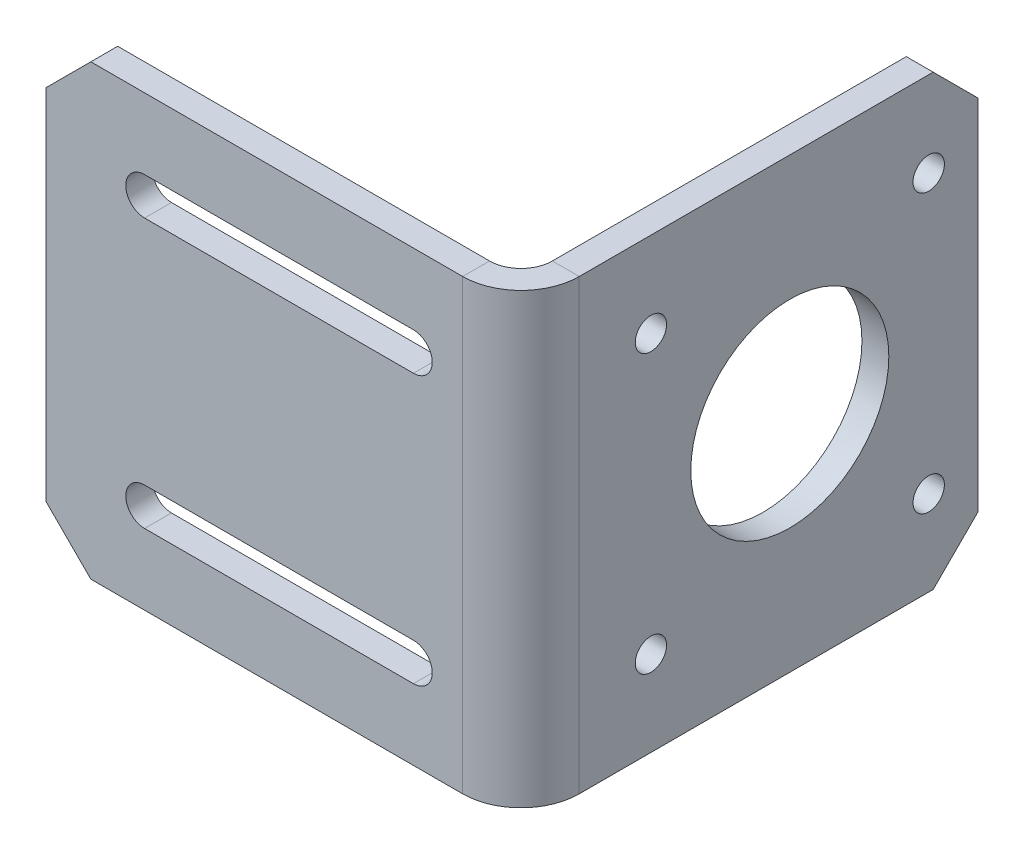
ISO-10303-21;
HEADER;
FILE_DESCRIPTION(('STEP AP214'),'2;1');
FILE_NAME('part.step','',(''),(''),'','','');
FILE_SCHEMA(('AUTOMOTIVE_DESIGN { 1 0 10303 214 1 1 1 1 }'));
ENDSEC;
DATA;
#1=APPLICATION_CONTEXT('core data for automotive mechanical design processes');
#2=APPLICATION_PROTOCOL_DEFINITION('international standard','automotive_design',2000,#1);
#3=PRODUCT_CONTEXT('',#1,'mechanical');
#4=PRODUCT('Part','Part','',(#3));
#5=PRODUCT_RELATED_PRODUCT_CATEGORY('part','',(#4));
#6=PRODUCT_DEFINITION_FORMATION('','',#4);
#7=PRODUCT_DEFINITION_CONTEXT('part definition',#1,'design');
#8=PRODUCT_DEFINITION('design','',#6,#7);
#9=PRODUCT_DEFINITION_SHAPE('','',#8);
#10=(LENGTH_UNIT() NAMED_UNIT(*) SI_UNIT(.MILLI.,.METRE.));
#11=(NAMED_UNIT(*) PLANE_ANGLE_UNIT() SI_UNIT($,.RADIAN.));
#12=(NAMED_UNIT(*) SI_UNIT($,.STERADIAN.) SOLID_ANGLE_UNIT());
#13=UNCERTAINTY_MEASURE_WITH_UNIT(LENGTH_MEASURE(1.E-05),#10,'distance_accuracy_value','');
#14=(GEOMETRIC_REPRESENTATION_CONTEXT(3) GLOBAL_UNCERTAINTY_ASSIGNED_CONTEXT((#13)) GLOBAL_UNIT_ASSIGNED_CONTEXT((#10,
#11,#12)) REPRESENTATION_CONTEXT('',''));
#15=CARTESIAN_POINT('',(0.,0.,0.));
#16=DIRECTION('',(0.,0.,1.));
#17=DIRECTION('',(1.,0.,0.));
#18=AXIS2_PLACEMENT_3D('',#15,#16,#17);
#19=CARTESIAN_POINT('',(-6.5,25.,0.));
#20=DIRECTION('',(0.,1.,0.));
#21=DIRECTION('',(0.,0.,1.));
#22=AXIS2_PLACEMENT_3D('',#19,#20,#21);
#23=PLANE('',#22);
#24=DIRECTION('',(0.,0.,-1.));
#25=VECTOR('',#24,1.);
#26=CARTESIAN_POINT('',(-6.5,25.,0.));
#27=LINE('',#26,#25);
#28=CARTESIAN_POINT('',(-6.5,25.,0.));
#29=VERTEX_POINT('',#28);
#30=CARTESIAN_POINT('',(-6.5,25.,-3.));
#31=VERTEX_POINT('',#30);
#32=EDGE_CURVE('E326',#29,#31,#27,.T.);
#33=ORIENTED_EDGE('',*,*,#32,.F.);
#34=CARTESIAN_POINT('',(-6.5,25.,-6.5));
#35=DIRECTION('',(0.,1.,0.));
#36=DIRECTION('',(0.,0.,1.));
#37=AXIS2_PLACEMENT_3D('',#34,#35,#36);
#38=CIRCLE('',#37,6.5);
#39=CARTESIAN_POINT('',(0.,25.,-6.5));
#40=VERTEX_POINT('',#39);
#41=EDGE_CURVE('E269',#40,#29,#38,.F.);
#42=ORIENTED_EDGE('',*,*,#41,.F.);
#43=DIRECTION('',(1.,0.,0.));
#44=VECTOR('',#43,1.);
#45=CARTESIAN_POINT('',(-3.,25.,-6.5));
#46=LINE('',#45,#44);
#47=CARTESIAN_POINT('',(-3.,25.,-6.5));
#48=VERTEX_POINT('',#47);
#49=EDGE_CURVE('E323',#48,#40,#46,.T.);
#50=ORIENTED_EDGE('',*,*,#49,.F.);
#51=CARTESIAN_POINT('',(-6.5,25.,-6.5));
#52=DIRECTION('',(0.,1.,0.));
#53=DIRECTION('',(1.,0.,0.));
#54=AXIS2_PLACEMENT_3D('',#51,#52,#53);
#55=CIRCLE('',#54,3.5);
#56=EDGE_CURVE('E276',#48,#31,#55,.F.);
#57=ORIENTED_EDGE('',*,*,#56,.T.);
#58=EDGE_LOOP('',(#33,#42,#50,#57));
#59=FACE_BOUND('',#58,.T.);
#60=ADVANCED_FACE('F38',(#59),#23,.T.);
#61=CARTESIAN_POINT('',(-3.,25.,-6.5));
#62=DIRECTION('',(0.,1.,0.));
#63=DIRECTION('',(0.,0.,1.));
#64=AXIS2_PLACEMENT_3D('',#61,#62,#63);
#65=PLANE('',#64);
#66=DIRECTION('',(-1.,0.,0.));
#67=VECTOR('',#66,1.);
#68=CARTESIAN_POINT('',(0.,25.,-3.));
#69=LINE('',#68,#67);
#70=CARTESIAN_POINT('',(-48.,25.,-2.99999999999999));
#71=VERTEX_POINT('',#70);
#72=EDGE_CURVE('E262',#31,#71,#69,.T.);
#73=ORIENTED_EDGE('',*,*,#72,.T.);
#74=DIRECTION('',(0.,0.,1.));
#75=VECTOR('',#74,1.);
#76=CARTESIAN_POINT('',(-48.,25.,-6.5));
#77=LINE('',#76,#75);
#78=CARTESIAN_POINT('',(-48.,25.,0.));
#79=VERTEX_POINT('',#78);
#80=EDGE_CURVE('E337',#71,#79,#77,.T.);
#81=ORIENTED_EDGE('',*,*,#80,.T.);
#82=DIRECTION('',(-1.,0.,0.));
#83=VECTOR('',#82,1.);
#84=CARTESIAN_POINT('',(0.,25.,0.));
#85=LINE('',#84,#83);
#86=EDGE_CURVE('E265',#29,#79,#85,.T.);
#87=ORIENTED_EDGE('',*,*,#86,.F.);
#88=ORIENTED_EDGE('',*,*,#32,.T.);
#89=EDGE_LOOP('',(#73,#81,#87,#88));
#90=FACE_BOUND('',#89,.T.);
#91=ADVANCED_FACE('F395',(#90),#65,.T.);
#92=CARTESIAN_POINT('',(0.,-25.,-6.5));
#93=DIRECTION('',(0.,-1.,0.));
#94=DIRECTION('',(0.,0.,-1.));
#95=AXIS2_PLACEMENT_3D('',#92,#93,#94);
#96=PLANE('',#95);
#97=DIRECTION('',(-1.,0.,0.));
#98=VECTOR('',#97,1.);
#99=CARTESIAN_POINT('',(0.,-25.,-6.5));
#100=LINE('',#99,#98);
#101=CARTESIAN_POINT('',(0.,-25.,-6.5));
#102=VERTEX_POINT('',#101);
#103=CARTESIAN_POINT('',(-3.,-25.,-6.5));
#104=VERTEX_POINT('',#103);
#105=EDGE_CURVE('E320',#102,#104,#100,.T.);
#106=ORIENTED_EDGE('',*,*,#105,.F.);
#107=CARTESIAN_POINT('',(-6.5,-25.,-6.5));
#108=DIRECTION('',(0.,1.,0.));
#109=DIRECTION('',(0.,0.,1.));
#110=AXIS2_PLACEMENT_3D('',#107,#108,#109);
#111=CIRCLE('',#110,6.5);
#112=CARTESIAN_POINT('',(-6.5,-25.,0.));
#113=VERTEX_POINT('',#112);
#114=EDGE_CURVE('E286',#102,#113,#111,.F.);
#115=ORIENTED_EDGE('',*,*,#114,.T.);
#116=DIRECTION('',(0.,0.,1.));
#117=VECTOR('',#116,1.);
#118=CARTESIAN_POINT('',(-6.5,-25.,-3.));
#119=LINE('',#118,#117);
#120=CARTESIAN_POINT('',(-6.5,-25.,-3.));
#121=VERTEX_POINT('',#120);
#122=EDGE_CURVE('E318',#121,#113,#119,.T.);
#123=ORIENTED_EDGE('',*,*,#122,.F.);
#124=CARTESIAN_POINT('',(-6.5,-25.,-6.5));
#125=DIRECTION('',(0.,1.,0.));
#126=DIRECTION('',(1.,0.,0.));
#127=AXIS2_PLACEMENT_3D('',#124,#125,#126);
#128=CIRCLE('',#127,3.5);
#129=EDGE_CURVE('E266',#104,#121,#128,.F.);
#130=ORIENTED_EDGE('',*,*,#129,.F.);
#131=EDGE_LOOP('',(#106,#115,#123,#130));
#132=FACE_BOUND('',#131,.T.);
#133=ADVANCED_FACE('F401',(#132),#96,.T.);
#134=CARTESIAN_POINT('',(-6.5,-25.,-3.));
#135=DIRECTION('',(0.,-1.,0.));
#136=DIRECTION('',(0.,0.,-1.));
#137=AXIS2_PLACEMENT_3D('',#134,#135,#136);
#138=PLANE('',#137);
#139=DIRECTION('',(0.,0.,-1.));
#140=VECTOR('',#139,1.);
#141=CARTESIAN_POINT('',(-3.,-25.,-51.));
#142=LINE('',#141,#140);
#143=CARTESIAN_POINT('',(-3.,-25.,-46.));
#144=VERTEX_POINT('',#143);
#145=EDGE_CURVE('E291',#144,#104,#142,.F.);
#146=ORIENTED_EDGE('',*,*,#145,.F.);
#147=DIRECTION('',(1.,0.,0.));
#148=VECTOR('',#147,1.);
#149=CARTESIAN_POINT('',(-6.5,-25.,-46.));
#150=LINE('',#149,#148);
#151=CARTESIAN_POINT('',(0.,-25.,-46.));
#152=VERTEX_POINT('',#151);
#153=EDGE_CURVE('E346',#144,#152,#150,.T.);
#154=ORIENTED_EDGE('',*,*,#153,.T.);
#155=DIRECTION('',(0.,0.,1.));
#156=VECTOR('',#155,1.);
#157=CARTESIAN_POINT('',(0.,-25.,-51.));
#158=LINE('',#157,#156);
#159=EDGE_CURVE('E289',#152,#102,#158,.T.);
#160=ORIENTED_EDGE('',*,*,#159,.T.);
#161=ORIENTED_EDGE('',*,*,#105,.T.);
#162=EDGE_LOOP('',(#146,#154,#160,#161));
#163=FACE_BOUND('',#162,.T.);
#164=ADVANCED_FACE('F430',(#163),#138,.T.);
#165=CARTESIAN_POINT('',(0.,25.,-3.));
#166=DIRECTION('',(0.,0.,1.));
#167=DIRECTION('',(1.,0.,0.));
#168=AXIS2_PLACEMENT_3D('',#165,#166,#167);
#169=PLANE('',#168);
#170=DIRECTION('',(-1.,0.,0.));
#171=VECTOR('',#170,1.);
#172=CARTESIAN_POINT('',(0.,17.1,-3.));
#173=LINE('',#172,#171);
#174=CARTESIAN_POINT('',(-12.,17.1,-3.));
#175=VERTEX_POINT('',#174);
#176=CARTESIAN_POINT('',(-42.,17.1,-3.));
#177=VERTEX_POINT('',#176);
#178=EDGE_CURVE('E240',#175,#177,#173,.T.);
#179=ORIENTED_EDGE('',*,*,#178,.T.);
#180=CARTESIAN_POINT('',(-42.,15.,-3.));
#181=DIRECTION('',(0.,0.,1.));
#182=DIRECTION('',(1.,0.,0.));
#183=AXIS2_PLACEMENT_3D('',#180,#181,#182);
#184=CIRCLE('',#183,2.10000000000001);
#185=CARTESIAN_POINT('',(-42.,12.9,-3.));
#186=VERTEX_POINT('',#185);
#187=EDGE_CURVE('E243',#177,#186,#184,.T.);
#188=ORIENTED_EDGE('',*,*,#187,.T.);
#189=DIRECTION('',(1.,0.,0.));
#190=VECTOR('',#189,1.);
#191=CARTESIAN_POINT('',(0.,12.9,-3.));
#192=LINE('',#191,#190);
#193=CARTESIAN_POINT('',(-12.,12.9,-3.));
#194=VERTEX_POINT('',#193);
#195=EDGE_CURVE('E237',#186,#194,#192,.T.);
#196=ORIENTED_EDGE('',*,*,#195,.T.);
#197=CARTESIAN_POINT('',(-12.,15.,-3.));
#198=DIRECTION('',(0.,0.,1.));
#199=DIRECTION('',(1.,0.,0.));
#200=AXIS2_PLACEMENT_3D('',#197,#198,#199);
#201=CIRCLE('',#200,2.1);
#202=EDGE_CURVE('E181',#194,#175,#201,.T.);
#203=ORIENTED_EDGE('',*,*,#202,.T.);
#204=EDGE_LOOP('',(#179,#188,#196,#203));
#205=FACE_BOUND('',#204,.T.);
#206=DIRECTION('',(-1.,0.,0.));
#207=VECTOR('',#206,1.);
#208=CARTESIAN_POINT('',(0.,-12.9,-3.));
#209=LINE('',#208,#207);
#210=CARTESIAN_POINT('',(-12.,-12.9,-3.));
#211=VERTEX_POINT('',#210);
#212=CARTESIAN_POINT('',(-42.,-12.9,-3.));
#213=VERTEX_POINT('',#212);
#214=EDGE_CURVE('E231',#211,#213,#209,.T.);
#215=ORIENTED_EDGE('',*,*,#214,.T.);
#216=CARTESIAN_POINT('',(-42.,-15.,-3.));
#217=DIRECTION('',(0.,0.,1.));
#218=DIRECTION('',(1.,0.,0.));
#219=AXIS2_PLACEMENT_3D('',#216,#217,#218);
#220=CIRCLE('',#219,2.10000000000001);
#221=CARTESIAN_POINT('',(-42.,-17.1,-3.));
#222=VERTEX_POINT('',#221);
#223=EDGE_CURVE('E234',#213,#222,#220,.T.);
#224=ORIENTED_EDGE('',*,*,#223,.T.);
#225=DIRECTION('',(1.,0.,0.));
#226=VECTOR('',#225,1.);
#227=CARTESIAN_POINT('',(0.,-17.1,-3.));
#228=LINE('',#227,#226);
#229=CARTESIAN_POINT('',(-12.,-17.1,-3.));
#230=VERTEX_POINT('',#229);
#231=EDGE_CURVE('E205',#222,#230,#228,.T.);
#232=ORIENTED_EDGE('',*,*,#231,.T.);
#233=CARTESIAN_POINT('',(-12.,-15.,-3.));
#234=DIRECTION('',(0.,0.,1.));
#235=DIRECTION('',(1.,0.,0.));
#236=AXIS2_PLACEMENT_3D('',#233,#234,#235);
#237=CIRCLE('',#236,2.1);
#238=EDGE_CURVE('E228',#230,#211,#237,.T.);
#239=ORIENTED_EDGE('',*,*,#238,.T.);
#240=EDGE_LOOP('',(#215,#224,#232,#239));
#241=FACE_BOUND('',#240,.T.);
#242=DIRECTION('',(0.,-1.,0.));
#243=VECTOR('',#242,1.);
#244=CARTESIAN_POINT('',(-53.,25.,-2.99999999999999));
#245=LINE('',#244,#243);
#246=CARTESIAN_POINT('',(-53.,20.,-2.99999999999999));
#247=VERTEX_POINT('',#246);
#248=CARTESIAN_POINT('',(-53.,-20.,-2.99999999999999));
#249=VERTEX_POINT('',#248);
#250=EDGE_CURVE('E315',#247,#249,#245,.T.);
#251=ORIENTED_EDGE('',*,*,#250,.F.);
#252=DIRECTION('',(-0.707106781186549,-0.707106781186547,0.));
#253=VECTOR('',#252,1.);
#254=CARTESIAN_POINT('',(-53.,20.,-2.99999999999999));
#255=LINE('',#254,#253);
#256=EDGE_CURVE('E335',#247,#71,#255,.F.);
#257=ORIENTED_EDGE('',*,*,#256,.T.);
#258=ORIENTED_EDGE('',*,*,#72,.F.);
#259=DIRECTION('',(0.,-1.,0.));
#260=VECTOR('',#259,1.);
#261=CARTESIAN_POINT('',(-6.5,25.,-3.));
#262=LINE('',#261,#260);
#263=EDGE_CURVE('E279',#31,#121,#262,.T.);
#264=ORIENTED_EDGE('',*,*,#263,.T.);
#265=DIRECTION('',(-1.,0.,0.));
#266=VECTOR('',#265,1.);
#267=CARTESIAN_POINT('',(0.,-25.,-3.));
#268=LINE('',#267,#266);
#269=CARTESIAN_POINT('',(-48.,-25.,-2.99999999999999));
#270=VERTEX_POINT('',#269);
#271=EDGE_CURVE('E280',#121,#270,#268,.T.);
#272=ORIENTED_EDGE('',*,*,#271,.T.);
#273=DIRECTION('',(-0.707106781186547,0.707106781186549,0.));
#274=VECTOR('',#273,1.);
#275=CARTESIAN_POINT('',(-48.,-25.,-2.99999999999999));
#276=LINE('',#275,#274);
#277=EDGE_CURVE('E333',#270,#249,#276,.T.);
#278=ORIENTED_EDGE('',*,*,#277,.T.);
#279=EDGE_LOOP('',(#251,#257,#258,#264,#272,#278));
#280=FACE_BOUND('',#279,.T.);
#281=ADVANCED_FACE('F457',(#205,#241,#280),#169,.F.);
#282=CARTESIAN_POINT('',(-53.,25.,0.));
#283=DIRECTION('',(-1.,0.,0.));
#284=DIRECTION('',(0.,0.,1.));
#285=AXIS2_PLACEMENT_3D('',#282,#283,#284);
#286=PLANE('',#285);
#287=DIRECTION('',(0.,-1.,0.));
#288=VECTOR('',#287,1.);
#289=CARTESIAN_POINT('',(-53.,25.,0.));
#290=LINE('',#289,#288);
#291=CARTESIAN_POINT('',(-53.,20.,0.));
#292=VERTEX_POINT('',#291);
#293=CARTESIAN_POINT('',(-53.,-20.,0.));
#294=VERTEX_POINT('',#293);
#295=EDGE_CURVE('E312',#292,#294,#290,.T.);
#296=ORIENTED_EDGE('',*,*,#295,.F.);
#297=DIRECTION('',(0.,0.,-1.));
#298=VECTOR('',#297,1.);
#299=CARTESIAN_POINT('',(-53.,20.,0.));
#300=LINE('',#299,#298);
#301=EDGE_CURVE('E330',#292,#247,#300,.T.);
#302=ORIENTED_EDGE('',*,*,#301,.T.);
#303=ORIENTED_EDGE('',*,*,#250,.T.);
#304=DIRECTION('',(0.,0.,1.));
#305=VECTOR('',#304,1.);
#306=CARTESIAN_POINT('',(-53.,-20.,0.));
#307=LINE('',#306,#305);
#308=EDGE_CURVE('E328',#249,#294,#307,.T.);
#309=ORIENTED_EDGE('',*,*,#308,.T.);
#310=EDGE_LOOP('',(#296,#302,#303,#309));
#311=FACE_BOUND('',#310,.T.);
#312=ADVANCED_FACE('F463',(#311),#286,.T.);
#313=CARTESIAN_POINT('',(0.,25.,0.));
#314=DIRECTION('',(0.,0.,1.));
#315=DIRECTION('',(1.,0.,0.));
#316=AXIS2_PLACEMENT_3D('',#313,#314,#315);
#317=PLANE('',#316);
#318=CARTESIAN_POINT('',(-42.,15.,0.));
#319=DIRECTION('',(0.,0.,1.));
#320=DIRECTION('',(1.,0.,0.));
#321=AXIS2_PLACEMENT_3D('',#318,#319,#320);
#322=CIRCLE('',#321,2.10000000000001);
#323=CARTESIAN_POINT('',(-42.,17.1,0.));
#324=VERTEX_POINT('',#323);
#325=CARTESIAN_POINT('',(-42.,12.9,0.));
#326=VERTEX_POINT('',#325);
#327=EDGE_CURVE('E193',#324,#326,#322,.T.);
#328=ORIENTED_EDGE('',*,*,#327,.F.);
#329=DIRECTION('',(-1.,0.,0.));
#330=VECTOR('',#329,1.);
#331=CARTESIAN_POINT('',(-42.,17.1,0.));
#332=LINE('',#331,#330);
#333=CARTESIAN_POINT('',(-12.,17.1,0.));
#334=VERTEX_POINT('',#333);
#335=EDGE_CURVE('E198',#334,#324,#332,.T.);
#336=ORIENTED_EDGE('',*,*,#335,.F.);
#337=CARTESIAN_POINT('',(-12.,15.,0.));
#338=DIRECTION('',(0.,0.,1.));
#339=DIRECTION('',(1.,0.,0.));
#340=AXIS2_PLACEMENT_3D('',#337,#338,#339);
#341=CIRCLE('',#340,2.1);
#342=CARTESIAN_POINT('',(-12.,12.9,0.));
#343=VERTEX_POINT('',#342);
#344=EDGE_CURVE('E178',#343,#334,#341,.T.);
#345=ORIENTED_EDGE('',*,*,#344,.F.);
#346=DIRECTION('',(1.,0.,0.));
#347=VECTOR('',#346,1.);
#348=CARTESIAN_POINT('',(-42.,12.9,0.));
#349=LINE('',#348,#347);
#350=EDGE_CURVE('E188',#326,#343,#349,.T.);
#351=ORIENTED_EDGE('',*,*,#350,.F.);
#352=EDGE_LOOP('',(#328,#336,#345,#351));
#353=FACE_BOUND('',#352,.T.);
#354=CARTESIAN_POINT('',(-42.,-15.,0.));
#355=DIRECTION('',(0.,0.,1.));
#356=DIRECTION('',(-1.,0.,0.));
#357=AXIS2_PLACEMENT_3D('',#354,#355,#356);
#358=CIRCLE('',#357,2.10000000000001);
#359=CARTESIAN_POINT('',(-42.,-12.9,0.));
#360=VERTEX_POINT('',#359);
#361=CARTESIAN_POINT('',(-42.,-17.1,0.));
#362=VERTEX_POINT('',#361);
#363=EDGE_CURVE('E208',#360,#362,#358,.T.);
#364=ORIENTED_EDGE('',*,*,#363,.F.);
#365=DIRECTION('',(-1.,0.,0.));
#366=VECTOR('',#365,1.);
#367=CARTESIAN_POINT('',(-42.,-12.9,0.));
#368=LINE('',#367,#366);
#369=CARTESIAN_POINT('',(-12.,-12.9,0.));
#370=VERTEX_POINT('',#369);
#371=EDGE_CURVE('E215',#370,#360,#368,.T.);
#372=ORIENTED_EDGE('',*,*,#371,.F.);
#373=CARTESIAN_POINT('',(-12.,-15.,0.));
#374=DIRECTION('',(0.,0.,1.));
#375=DIRECTION('',(-1.,0.,0.));
#376=AXIS2_PLACEMENT_3D('',#373,#374,#375);
#377=CIRCLE('',#376,2.1);
#378=CARTESIAN_POINT('',(-12.,-17.1,0.));
#379=VERTEX_POINT('',#378);
#380=EDGE_CURVE('E212',#379,#370,#377,.T.);
#381=ORIENTED_EDGE('',*,*,#380,.F.);
#382=DIRECTION('',(1.,0.,0.));
#383=VECTOR('',#382,1.);
#384=CARTESIAN_POINT('',(-42.,-17.1,0.));
#385=LINE('',#384,#383);
#386=EDGE_CURVE('E210',#362,#379,#385,.T.);
#387=ORIENTED_EDGE('',*,*,#386,.F.);
#388=EDGE_LOOP('',(#364,#372,#381,#387));
#389=FACE_BOUND('',#388,.T.);
#390=ORIENTED_EDGE('',*,*,#86,.T.);
#391=DIRECTION('',(0.707106781186549,0.707106781186547,0.));
#392=VECTOR('',#391,1.);
#393=CARTESIAN_POINT('',(-23.9999999999999,49.,0.));
#394=LINE('',#393,#392);
#395=EDGE_CURVE('E341',#79,#292,#394,.F.);
#396=ORIENTED_EDGE('',*,*,#395,.T.);
#397=ORIENTED_EDGE('',*,*,#295,.T.);
#398=DIRECTION('',(0.707106781186547,-0.707106781186549,0.));
#399=VECTOR('',#398,1.);
#400=CARTESIAN_POINT('',(-49.0000000000001,-23.9999999999999,0.));
#401=LINE('',#400,#399);
#402=CARTESIAN_POINT('',(-48.,-25.,0.));
#403=VERTEX_POINT('',#402);
#404=EDGE_CURVE('E339',#294,#403,#401,.T.);
#405=ORIENTED_EDGE('',*,*,#404,.T.);
#406=DIRECTION('',(-1.,0.,0.));
#407=VECTOR('',#406,1.);
#408=CARTESIAN_POINT('',(0.,-25.,0.));
#409=LINE('',#408,#407);
#410=EDGE_CURVE('E283',#113,#403,#409,.T.);
#411=ORIENTED_EDGE('',*,*,#410,.F.);
#412=DIRECTION('',(0.,-1.,0.));
#413=VECTOR('',#412,1.);
#414=CARTESIAN_POINT('',(-6.5,25.,0.));
#415=LINE('',#414,#413);
#416=EDGE_CURVE('E309',#29,#113,#415,.T.);
#417=ORIENTED_EDGE('',*,*,#416,.F.);
#418=EDGE_LOOP('',(#390,#396,#397,#405,#411,#417));
#419=FACE_BOUND('',#418,.T.);
#420=ADVANCED_FACE('F195',(#353,#389,#419),#317,.T.);
#421=CARTESIAN_POINT('',(-6.5,25.,-6.5));
#422=DIRECTION('',(0.,-1.,0.));
#423=DIRECTION('',(0.,0.,-1.));
#424=AXIS2_PLACEMENT_3D('',#421,#422,#423);
#425=CYLINDRICAL_SURFACE('',#424,6.5);
#426=ORIENTED_EDGE('',*,*,#114,.F.);
#427=DIRECTION('',(0.,-1.,0.));
#428=VECTOR('',#427,1.);
#429=CARTESIAN_POINT('',(0.,25.,-6.5));
#430=LINE('',#429,#428);
#431=EDGE_CURVE('E306',#40,#102,#430,.T.);
#432=ORIENTED_EDGE('',*,*,#431,.F.);
#433=ORIENTED_EDGE('',*,*,#41,.T.);
#434=ORIENTED_EDGE('',*,*,#416,.T.);
#435=EDGE_LOOP('',(#426,#432,#433,#434));
#436=FACE_BOUND('',#435,.T.);
#437=ADVANCED_FACE('F447',(#436),#425,.T.);
#438=CARTESIAN_POINT('',(0.,25.,-51.));
#439=DIRECTION('',(1.,0.,0.));
#440=DIRECTION('',(0.,0.,-1.));
#441=AXIS2_PLACEMENT_3D('',#438,#439,#440);
#442=PLANE('',#441);
#443=CARTESIAN_POINT('',(0.,-15.5,-45.5));
#444=DIRECTION('',(1.,0.,0.));
#445=DIRECTION('',(0.,0.,-1.));
#446=AXIS2_PLACEMENT_3D('',#443,#444,#445);
#447=CIRCLE('',#446,1.75);
#448=CARTESIAN_POINT('',(0.,-15.5,-47.25));
#449=VERTEX_POINT('',#448);
#450=EDGE_CURVE('E246',#449,#449,#447,.T.);
#451=ORIENTED_EDGE('',*,*,#450,.F.);
#452=EDGE_LOOP('',(#451));
#453=FACE_BOUND('',#452,.T.);
#454=CARTESIAN_POINT('',(0.,15.5,-45.5));
#455=DIRECTION('',(1.,0.,0.));
#456=DIRECTION('',(0.,0.,-1.));
#457=AXIS2_PLACEMENT_3D('',#454,#455,#456);
#458=CIRCLE('',#457,1.75);
#459=CARTESIAN_POINT('',(0.,15.5,-47.25));
#460=VERTEX_POINT('',#459);
#461=EDGE_CURVE('E254',#460,#460,#458,.T.);
#462=ORIENTED_EDGE('',*,*,#461,.F.);
#463=EDGE_LOOP('',(#462));
#464=FACE_BOUND('',#463,.T.);
#465=CARTESIAN_POINT('',(0.,-15.5,-14.5));
#466=DIRECTION('',(1.,0.,0.));
#467=DIRECTION('',(0.,0.,-1.));
#468=AXIS2_PLACEMENT_3D('',#465,#466,#467);
#469=CIRCLE('',#468,1.75);
#470=CARTESIAN_POINT('',(0.,-15.5,-16.25));
#471=VERTEX_POINT('',#470);
#472=EDGE_CURVE('E251',#471,#471,#469,.T.);
#473=ORIENTED_EDGE('',*,*,#472,.F.);
#474=EDGE_LOOP('',(#473));
#475=FACE_BOUND('',#474,.T.);
#476=CARTESIAN_POINT('',(0.,15.5,-14.5));
#477=DIRECTION('',(1.,0.,0.));
#478=DIRECTION('',(0.,0.,-1.));
#479=AXIS2_PLACEMENT_3D('',#476,#477,#478);
#480=CIRCLE('',#479,1.75);
#481=CARTESIAN_POINT('',(0.,15.5,-16.25));
#482=VERTEX_POINT('',#481);
#483=EDGE_CURVE('E247',#482,#482,#480,.T.);
#484=ORIENTED_EDGE('',*,*,#483,.F.);
#485=EDGE_LOOP('',(#484));
#486=FACE_BOUND('',#485,.T.);
#487=CARTESIAN_POINT('',(0.,0.,-30.));
#488=DIRECTION('',(1.,0.,0.));
#489=DIRECTION('',(0.,0.,-1.));
#490=AXIS2_PLACEMENT_3D('',#487,#488,#489);
#491=CIRCLE('',#490,11.05);
#492=CARTESIAN_POINT('',(0.,0.,-41.05));
#493=VERTEX_POINT('',#492);
#494=EDGE_CURVE('E250',#493,#493,#491,.T.);
#495=ORIENTED_EDGE('',*,*,#494,.F.);
#496=EDGE_LOOP('',(#495));
#497=FACE_BOUND('',#496,.T.);
#498=ORIENTED_EDGE('',*,*,#159,.F.);
#499=DIRECTION('',(0.,-0.707106781186549,0.707106781186547));
#500=VECTOR('',#499,1.);
#501=CARTESIAN_POINT('',(0.,2.50000000000007,-73.5));
#502=LINE('',#501,#500);
#503=CARTESIAN_POINT('',(0.,-20.,-51.));
#504=VERTEX_POINT('',#503);
#505=EDGE_CURVE('E351',#152,#504,#502,.F.);
#506=ORIENTED_EDGE('',*,*,#505,.T.);
#507=DIRECTION('',(0.,-1.,0.));
#508=VECTOR('',#507,1.);
#509=CARTESIAN_POINT('',(0.,25.,-51.));
#510=LINE('',#509,#508);
#511=CARTESIAN_POINT('',(0.,20.,-51.));
#512=VERTEX_POINT('',#511);
#513=EDGE_CURVE('E303',#512,#504,#510,.T.);
#514=ORIENTED_EDGE('',*,*,#513,.F.);
#515=DIRECTION('',(0.,-0.707106781186547,-0.707106781186549));
#516=VECTOR('',#515,1.);
#517=CARTESIAN_POINT('',(0.,22.5,-48.5));
#518=LINE('',#517,#516);
#519=CARTESIAN_POINT('',(0.,25.,-46.));
#520=VERTEX_POINT('',#519);
#521=EDGE_CURVE('E349',#512,#520,#518,.F.);
#522=ORIENTED_EDGE('',*,*,#521,.T.);
#523=DIRECTION('',(0.,0.,1.));
#524=VECTOR('',#523,1.);
#525=CARTESIAN_POINT('',(0.,25.,-51.));
#526=LINE('',#525,#524);
#527=EDGE_CURVE('E272',#520,#40,#526,.T.);
#528=ORIENTED_EDGE('',*,*,#527,.T.);
#529=ORIENTED_EDGE('',*,*,#431,.T.);
#530=EDGE_LOOP('',(#498,#506,#514,#522,#528,#529));
#531=FACE_BOUND('',#530,.T.);
#532=ADVANCED_FACE('F655',(#453,#464,#475,#486,#497,#531),#442,.T.);
#533=CARTESIAN_POINT('',(-3.,25.,-51.));
#534=DIRECTION('',(0.,0.,-1.));
#535=DIRECTION('',(-1.,0.,0.));
#536=AXIS2_PLACEMENT_3D('',#533,#534,#535);
#537=PLANE('',#536);
#538=ORIENTED_EDGE('',*,*,#513,.T.);
#539=DIRECTION('',(-1.,0.,0.));
#540=VECTOR('',#539,1.);
#541=CARTESIAN_POINT('',(-3.,-20.,-51.));
#542=LINE('',#541,#540);
#543=CARTESIAN_POINT('',(-3.,-20.,-51.));
#544=VERTEX_POINT('',#543);
#545=EDGE_CURVE('E356',#504,#544,#542,.T.);
#546=ORIENTED_EDGE('',*,*,#545,.T.);
#547=DIRECTION('',(0.,-1.,0.));
#548=VECTOR('',#547,1.);
#549=CARTESIAN_POINT('',(-3.,25.,-51.));
#550=LINE('',#549,#548);
#551=CARTESIAN_POINT('',(-3.,20.,-51.));
#552=VERTEX_POINT('',#551);
#553=EDGE_CURVE('E300',#552,#544,#550,.T.);
#554=ORIENTED_EDGE('',*,*,#553,.F.);
#555=DIRECTION('',(1.,0.,0.));
#556=VECTOR('',#555,1.);
#557=CARTESIAN_POINT('',(-3.,20.,-51.));
#558=LINE('',#557,#556);
#559=EDGE_CURVE('E353',#552,#512,#558,.T.);
#560=ORIENTED_EDGE('',*,*,#559,.T.);
#561=EDGE_LOOP('',(#538,#546,#554,#560));
#562=FACE_BOUND('',#561,.T.);
#563=ADVANCED_FACE('F679',(#562),#537,.T.);
#564=CARTESIAN_POINT('',(-3.,25.,-51.));
#565=DIRECTION('',(1.,0.,0.));
#566=DIRECTION('',(0.,0.,-1.));
#567=AXIS2_PLACEMENT_3D('',#564,#565,#566);
#568=PLANE('',#567);
#569=CARTESIAN_POINT('',(-3.,-15.5,-45.5));
#570=DIRECTION('',(1.,0.,0.));
#571=DIRECTION('',(0.,0.,-1.));
#572=AXIS2_PLACEMENT_3D('',#569,#570,#571);
#573=CIRCLE('',#572,1.75);
#574=CARTESIAN_POINT('',(-3.,-15.5,-47.25));
#575=VERTEX_POINT('',#574);
#576=EDGE_CURVE('E42',#575,#575,#573,.T.);
#577=ORIENTED_EDGE('',*,*,#576,.T.);
#578=EDGE_LOOP('',(#577));
#579=FACE_BOUND('',#578,.T.);
#580=CARTESIAN_POINT('',(-3.,15.5,-45.5));
#581=DIRECTION('',(1.,0.,0.));
#582=DIRECTION('',(0.,0.,-1.));
#583=AXIS2_PLACEMENT_3D('',#580,#581,#582);
#584=CIRCLE('',#583,1.75);
#585=CARTESIAN_POINT('',(-3.,15.5,-47.25));
#586=VERTEX_POINT('',#585);
#587=EDGE_CURVE('E368',#586,#586,#584,.T.);
#588=ORIENTED_EDGE('',*,*,#587,.T.);
#589=EDGE_LOOP('',(#588));
#590=FACE_BOUND('',#589,.T.);
#591=CARTESIAN_POINT('',(-3.,-15.5,-14.5));
#592=DIRECTION('',(1.,0.,0.));
#593=DIRECTION('',(0.,0.,-1.));
#594=AXIS2_PLACEMENT_3D('',#591,#592,#593);
#595=CIRCLE('',#594,1.75);
#596=CARTESIAN_POINT('',(-3.,-15.5,-16.25));
#597=VERTEX_POINT('',#596);
#598=EDGE_CURVE('E366',#597,#597,#595,.T.);
#599=ORIENTED_EDGE('',*,*,#598,.T.);
#600=EDGE_LOOP('',(#599));
#601=FACE_BOUND('',#600,.T.);
#602=CARTESIAN_POINT('',(-3.,15.5,-14.5));
#603=DIRECTION('',(1.,0.,0.));
#604=DIRECTION('',(0.,0.,-1.));
#605=AXIS2_PLACEMENT_3D('',#602,#603,#604);
#606=CIRCLE('',#605,1.75);
#607=CARTESIAN_POINT('',(-3.,15.5,-16.25));
#608=VERTEX_POINT('',#607);
#609=EDGE_CURVE('E363',#608,#608,#606,.T.);
#610=ORIENTED_EDGE('',*,*,#609,.T.);
#611=EDGE_LOOP('',(#610));
#612=FACE_BOUND('',#611,.T.);
#613=CARTESIAN_POINT('',(-3.,0.,-30.));
#614=DIRECTION('',(1.,0.,0.));
#615=DIRECTION('',(0.,0.,-1.));
#616=AXIS2_PLACEMENT_3D('',#613,#614,#615);
#617=CIRCLE('',#616,11.05);
#618=CARTESIAN_POINT('',(-3.,0.,-41.05));
#619=VERTEX_POINT('',#618);
#620=EDGE_CURVE('E261',#619,#619,#617,.T.);
#621=ORIENTED_EDGE('',*,*,#620,.T.);
#622=EDGE_LOOP('',(#621));
#623=FACE_BOUND('',#622,.T.);
#624=ORIENTED_EDGE('',*,*,#553,.T.);
#625=DIRECTION('',(0.,0.707106781186549,-0.707106781186547));
#626=VECTOR('',#625,1.);
#627=CARTESIAN_POINT('',(-3.,-25.,-46.));
#628=LINE('',#627,#626);
#629=EDGE_CURVE('E47',#544,#144,#628,.F.);
#630=ORIENTED_EDGE('',*,*,#629,.T.);
#631=ORIENTED_EDGE('',*,*,#145,.T.);
#632=DIRECTION('',(0.,-1.,0.));
#633=VECTOR('',#632,1.);
#634=CARTESIAN_POINT('',(-3.,25.,-6.5));
#635=LINE('',#634,#633);
#636=EDGE_CURVE('E297',#48,#104,#635,.T.);
#637=ORIENTED_EDGE('',*,*,#636,.F.);
#638=DIRECTION('',(0.,0.,-1.));
#639=VECTOR('',#638,1.);
#640=CARTESIAN_POINT('',(-3.,25.,-51.));
#641=LINE('',#640,#639);
#642=CARTESIAN_POINT('',(-3.,25.,-46.));
#643=VERTEX_POINT('',#642);
#644=EDGE_CURVE('E274',#643,#48,#641,.F.);
#645=ORIENTED_EDGE('',*,*,#644,.F.);
#646=DIRECTION('',(0.,0.707106781186547,0.707106781186549));
#647=VECTOR('',#646,1.);
#648=CARTESIAN_POINT('',(-3.,20.,-51.));
#649=LINE('',#648,#647);
#650=EDGE_CURVE('E358',#643,#552,#649,.F.);
#651=ORIENTED_EDGE('',*,*,#650,.T.);
#652=EDGE_LOOP('',(#624,#630,#631,#637,#645,#651));
#653=FACE_BOUND('',#652,.T.);
#654=ADVANCED_FACE('F375',(#579,#590,#601,#612,#623,#653),#568,.F.);
#655=CARTESIAN_POINT('',(-6.5,25.,-6.5));
#656=DIRECTION('',(0.,-1.,0.));
#657=DIRECTION('',(0.,0.,-1.));
#658=AXIS2_PLACEMENT_3D('',#655,#656,#657);
#659=CYLINDRICAL_SURFACE('',#658,3.5);
#660=ORIENTED_EDGE('',*,*,#129,.T.);
#661=ORIENTED_EDGE('',*,*,#263,.F.);
#662=ORIENTED_EDGE('',*,*,#56,.F.);
#663=ORIENTED_EDGE('',*,*,#636,.T.);
#664=EDGE_LOOP('',(#660,#661,#662,#663));
#665=FACE_BOUND('',#664,.T.);
#666=ADVANCED_FACE('F437',(#665),#659,.F.);
#667=CARTESIAN_POINT('',(-6.5,25.,-6.5));
#668=DIRECTION('',(0.,1.,0.));
#669=DIRECTION('',(1.,0.,0.));
#670=AXIS2_PLACEMENT_3D('',#667,#668,#669);
#671=PLANE('',#670);
#672=ORIENTED_EDGE('',*,*,#527,.F.);
#673=DIRECTION('',(-1.,0.,0.));
#674=VECTOR('',#673,1.);
#675=CARTESIAN_POINT('',(-6.5,25.,-46.));
#676=LINE('',#675,#674);
#677=EDGE_CURVE('E11',#520,#643,#676,.T.);
#678=ORIENTED_EDGE('',*,*,#677,.T.);
#679=ORIENTED_EDGE('',*,*,#644,.T.);
#680=ORIENTED_EDGE('',*,*,#49,.T.);
#681=EDGE_LOOP('',(#672,#678,#679,#680));
#682=FACE_BOUND('',#681,.T.);
#683=ADVANCED_FACE('F646',(#682),#671,.T.);
#684=CARTESIAN_POINT('',(-6.5,-25.,-6.5));
#685=DIRECTION('',(0.,1.,0.));
#686=DIRECTION('',(1.,0.,0.));
#687=AXIS2_PLACEMENT_3D('',#684,#685,#686);
#688=PLANE('',#687);
#689=ORIENTED_EDGE('',*,*,#410,.T.);
#690=DIRECTION('',(0.,0.,-1.));
#691=VECTOR('',#690,1.);
#692=CARTESIAN_POINT('',(-48.,-25.,-2.99999999999999));
#693=LINE('',#692,#691);
#694=EDGE_CURVE('E343',#403,#270,#693,.T.);
#695=ORIENTED_EDGE('',*,*,#694,.T.);
#696=ORIENTED_EDGE('',*,*,#271,.F.);
#697=ORIENTED_EDGE('',*,*,#122,.T.);
#698=EDGE_LOOP('',(#689,#695,#696,#697));
#699=FACE_BOUND('',#698,.T.);
#700=ADVANCED_FACE('F410',(#699),#688,.F.);
#701=CARTESIAN_POINT('',(-53.,20.,0.));
#702=DIRECTION('',(0.707106781186546,-0.707106781186548,0.));
#703=DIRECTION('',(0.,0.,-1.));
#704=AXIS2_PLACEMENT_3D('',#701,#702,#703);
#705=PLANE('',#704);
#706=ORIENTED_EDGE('',*,*,#395,.F.);
#707=ORIENTED_EDGE('',*,*,#80,.F.);
#708=ORIENTED_EDGE('',*,*,#256,.F.);
#709=ORIENTED_EDGE('',*,*,#301,.F.);
#710=EDGE_LOOP('',(#706,#707,#708,#709));
#711=FACE_BOUND('',#710,.T.);
#712=ADVANCED_FACE('F406',(#711),#705,.F.);
#713=CARTESIAN_POINT('',(-48.,-25.,-6.5));
#714=DIRECTION('',(-0.707106781186549,-0.707106781186547,0.));
#715=DIRECTION('',(0.,0.,1.));
#716=AXIS2_PLACEMENT_3D('',#713,#714,#715);
#717=PLANE('',#716);
#718=ORIENTED_EDGE('',*,*,#404,.F.);
#719=ORIENTED_EDGE('',*,*,#308,.F.);
#720=ORIENTED_EDGE('',*,*,#277,.F.);
#721=ORIENTED_EDGE('',*,*,#694,.F.);
#722=EDGE_LOOP('',(#718,#719,#720,#721));
#723=FACE_BOUND('',#722,.T.);
#724=ADVANCED_FACE('F409',(#723),#717,.T.);
#725=CARTESIAN_POINT('',(-6.5,-25.,-46.));
#726=DIRECTION('',(0.,0.707106781186547,0.707106781186549));
#727=DIRECTION('',(1.,0.,0.));
#728=AXIS2_PLACEMENT_3D('',#725,#726,#727);
#729=PLANE('',#728);
#730=ORIENTED_EDGE('',*,*,#629,.F.);
#731=ORIENTED_EDGE('',*,*,#545,.F.);
#732=ORIENTED_EDGE('',*,*,#505,.F.);
#733=ORIENTED_EDGE('',*,*,#153,.F.);
#734=EDGE_LOOP('',(#730,#731,#732,#733));
#735=FACE_BOUND('',#734,.T.);
#736=ADVANCED_FACE('F413',(#735),#729,.F.);
#737=CARTESIAN_POINT('',(-3.,20.,-51.));
#738=DIRECTION('',(0.,-0.707106781186548,0.707106781186546));
#739=DIRECTION('',(1.,0.,0.));
#740=AXIS2_PLACEMENT_3D('',#737,#738,#739);
#741=PLANE('',#740);
#742=ORIENTED_EDGE('',*,*,#650,.F.);
#743=ORIENTED_EDGE('',*,*,#677,.F.);
#744=ORIENTED_EDGE('',*,*,#521,.F.);
#745=ORIENTED_EDGE('',*,*,#559,.F.);
#746=EDGE_LOOP('',(#742,#743,#744,#745));
#747=FACE_BOUND('',#746,.T.);
#748=ADVANCED_FACE('F40',(#747),#741,.F.);
#749=CARTESIAN_POINT('',(-53.,0.,-30.));
#750=DIRECTION('',(1.,0.,0.));
#751=DIRECTION('',(0.,0.,-1.));
#752=AXIS2_PLACEMENT_3D('',#749,#750,#751);
#753=CYLINDRICAL_SURFACE('',#752,11.05);
#754=ORIENTED_EDGE('',*,*,#494,.T.);
#755=EDGE_LOOP('',(#754));
#756=FACE_BOUND('',#755,.T.);
#757=ORIENTED_EDGE('',*,*,#620,.F.);
#758=EDGE_LOOP('',(#757));
#759=FACE_BOUND('',#758,.T.);
#760=ADVANCED_FACE('F420',(#756,#759),#753,.F.);
#761=CARTESIAN_POINT('',(-53.,15.5,-14.5));
#762=DIRECTION('',(1.,0.,0.));
#763=DIRECTION('',(0.,0.,-1.));
#764=AXIS2_PLACEMENT_3D('',#761,#762,#763);
#765=CYLINDRICAL_SURFACE('',#764,1.75);
#766=ORIENTED_EDGE('',*,*,#483,.T.);
#767=EDGE_LOOP('',(#766));
#768=FACE_BOUND('',#767,.T.);
#769=ORIENTED_EDGE('',*,*,#609,.F.);
#770=EDGE_LOOP('',(#769));
#771=FACE_BOUND('',#770,.T.);
#772=ADVANCED_FACE('F608',(#768,#771),#765,.F.);
#773=CARTESIAN_POINT('',(-53.,-15.5,-14.5));
#774=DIRECTION('',(1.,0.,0.));
#775=DIRECTION('',(0.,0.,-1.));
#776=AXIS2_PLACEMENT_3D('',#773,#774,#775);
#777=CYLINDRICAL_SURFACE('',#776,1.75);
#778=ORIENTED_EDGE('',*,*,#472,.T.);
#779=EDGE_LOOP('',(#778));
#780=FACE_BOUND('',#779,.T.);
#781=ORIENTED_EDGE('',*,*,#598,.F.);
#782=EDGE_LOOP('',(#781));
#783=FACE_BOUND('',#782,.T.);
#784=ADVANCED_FACE('F390',(#780,#783),#777,.F.);
#785=CARTESIAN_POINT('',(-53.,15.5,-45.5));
#786=DIRECTION('',(1.,0.,0.));
#787=DIRECTION('',(0.,0.,-1.));
#788=AXIS2_PLACEMENT_3D('',#785,#786,#787);
#789=CYLINDRICAL_SURFACE('',#788,1.75);
#790=ORIENTED_EDGE('',*,*,#461,.T.);
#791=EDGE_LOOP('',(#790));
#792=FACE_BOUND('',#791,.T.);
#793=ORIENTED_EDGE('',*,*,#587,.F.);
#794=EDGE_LOOP('',(#793));
#795=FACE_BOUND('',#794,.T.);
#796=ADVANCED_FACE('F380',(#792,#795),#789,.F.);
#797=CARTESIAN_POINT('',(-53.,-15.5,-45.5));
#798=DIRECTION('',(1.,0.,0.));
#799=DIRECTION('',(0.,0.,-1.));
#800=AXIS2_PLACEMENT_3D('',#797,#798,#799);
#801=CYLINDRICAL_SURFACE('',#800,1.75);
#802=ORIENTED_EDGE('',*,*,#450,.T.);
#803=EDGE_LOOP('',(#802));
#804=FACE_BOUND('',#803,.T.);
#805=ORIENTED_EDGE('',*,*,#576,.F.);
#806=EDGE_LOOP('',(#805));
#807=FACE_BOUND('',#806,.T.);
#808=ADVANCED_FACE('F377',(#804,#807),#801,.F.);
#809=CARTESIAN_POINT('',(-42.,-15.,-51.));
#810=DIRECTION('',(0.,0.,1.));
#811=DIRECTION('',(1.,0.,0.));
#812=AXIS2_PLACEMENT_3D('',#809,#810,#811);
#813=CYLINDRICAL_SURFACE('',#812,2.10000000000001);
#814=DIRECTION('',(0.,0.,1.));
#815=VECTOR('',#814,1.);
#816=CARTESIAN_POINT('',(-42.,-12.9,-51.));
#817=LINE('',#816,#815);
#818=EDGE_CURVE('E219',#213,#360,#817,.T.);
#819=ORIENTED_EDGE('',*,*,#818,.T.);
#820=ORIENTED_EDGE('',*,*,#363,.T.);
#821=DIRECTION('',(0.,0.,1.));
#822=VECTOR('',#821,1.);
#823=CARTESIAN_POINT('',(-42.,-17.1,-51.));
#824=LINE('',#823,#822);
#825=EDGE_CURVE('E218',#222,#362,#824,.T.);
#826=ORIENTED_EDGE('',*,*,#825,.F.);
#827=ORIENTED_EDGE('',*,*,#223,.F.);
#828=EDGE_LOOP('',(#819,#820,#826,#827));
#829=FACE_BOUND('',#828,.T.);
#830=ADVANCED_FACE('F379',(#829),#813,.F.);
#831=CARTESIAN_POINT('',(-42.,-12.9,-51.));
#832=DIRECTION('',(0.,1.,0.));
#833=DIRECTION('',(-1.,0.,0.));
#834=AXIS2_PLACEMENT_3D('',#831,#832,#833);
#835=PLANE('',#834);
#836=DIRECTION('',(0.,0.,1.));
#837=VECTOR('',#836,1.);
#838=CARTESIAN_POINT('',(-12.,-12.9,-51.));
#839=LINE('',#838,#837);
#840=EDGE_CURVE('E221',#211,#370,#839,.T.);
#841=ORIENTED_EDGE('',*,*,#840,.T.);
#842=ORIENTED_EDGE('',*,*,#371,.T.);
#843=ORIENTED_EDGE('',*,*,#818,.F.);
#844=ORIENTED_EDGE('',*,*,#214,.F.);
#845=EDGE_LOOP('',(#841,#842,#843,#844));
#846=FACE_BOUND('',#845,.T.);
#847=ADVANCED_FACE('F387',(#846),#835,.F.);
#848=CARTESIAN_POINT('',(-12.,-15.,-51.));
#849=DIRECTION('',(0.,0.,1.));
#850=DIRECTION('',(1.,0.,0.));
#851=AXIS2_PLACEMENT_3D('',#848,#849,#850);
#852=CYLINDRICAL_SURFACE('',#851,2.1);
#853=DIRECTION('',(0.,0.,1.));
#854=VECTOR('',#853,1.);
#855=CARTESIAN_POINT('',(-12.,-17.1,-51.));
#856=LINE('',#855,#854);
#857=EDGE_CURVE('E63',#230,#379,#856,.T.);
#858=ORIENTED_EDGE('',*,*,#857,.T.);
#859=ORIENTED_EDGE('',*,*,#380,.T.);
#860=ORIENTED_EDGE('',*,*,#840,.F.);
#861=ORIENTED_EDGE('',*,*,#238,.F.);
#862=EDGE_LOOP('',(#858,#859,#860,#861));
#863=FACE_BOUND('',#862,.T.);
#864=ADVANCED_FACE('F520',(#863),#852,.F.);
#865=CARTESIAN_POINT('',(-42.,-17.1,-51.));
#866=DIRECTION('',(0.,-1.,0.));
#867=DIRECTION('',(1.,0.,0.));
#868=AXIS2_PLACEMENT_3D('',#865,#866,#867);
#869=PLANE('',#868);
#870=ORIENTED_EDGE('',*,*,#825,.T.);
#871=ORIENTED_EDGE('',*,*,#386,.T.);
#872=ORIENTED_EDGE('',*,*,#857,.F.);
#873=ORIENTED_EDGE('',*,*,#231,.F.);
#874=EDGE_LOOP('',(#870,#871,#872,#873));
#875=FACE_BOUND('',#874,.T.);
#876=ADVANCED_FACE('F531',(#875),#869,.F.);
#877=CARTESIAN_POINT('',(-42.,15.,-51.));
#878=DIRECTION('',(0.,0.,1.));
#879=DIRECTION('',(1.,0.,0.));
#880=AXIS2_PLACEMENT_3D('',#877,#878,#879);
#881=CYLINDRICAL_SURFACE('',#880,2.10000000000001);
#882=DIRECTION('',(0.,0.,1.));
#883=VECTOR('',#882,1.);
#884=CARTESIAN_POINT('',(-42.,17.1,-51.));
#885=LINE('',#884,#883);
#886=EDGE_CURVE('E203',#177,#324,#885,.T.);
#887=ORIENTED_EDGE('',*,*,#886,.T.);
#888=ORIENTED_EDGE('',*,*,#327,.T.);
#889=DIRECTION('',(0.,0.,1.));
#890=VECTOR('',#889,1.);
#891=CARTESIAN_POINT('',(-42.,12.9,-51.));
#892=LINE('',#891,#890);
#893=EDGE_CURVE('E184',#186,#326,#892,.T.);
#894=ORIENTED_EDGE('',*,*,#893,.F.);
#895=ORIENTED_EDGE('',*,*,#187,.F.);
#896=EDGE_LOOP('',(#887,#888,#894,#895));
#897=FACE_BOUND('',#896,.T.);
#898=ADVANCED_FACE('F542',(#897),#881,.F.);
#899=CARTESIAN_POINT('',(-42.,17.1,-51.));
#900=DIRECTION('',(0.,1.,0.));
#901=DIRECTION('',(-1.,0.,0.));
#902=AXIS2_PLACEMENT_3D('',#899,#900,#901);
#903=PLANE('',#902);
#904=DIRECTION('',(0.,0.,1.));
#905=VECTOR('',#904,1.);
#906=CARTESIAN_POINT('',(-12.,17.1,-51.));
#907=LINE('',#906,#905);
#908=EDGE_CURVE('E183',#175,#334,#907,.T.);
#909=ORIENTED_EDGE('',*,*,#908,.T.);
#910=ORIENTED_EDGE('',*,*,#335,.T.);
#911=ORIENTED_EDGE('',*,*,#886,.F.);
#912=ORIENTED_EDGE('',*,*,#178,.F.);
#913=EDGE_LOOP('',(#909,#910,#911,#912));
#914=FACE_BOUND('',#913,.T.);
#915=ADVANCED_FACE('F552',(#914),#903,.F.);
#916=CARTESIAN_POINT('',(-12.,15.,-51.));
#917=DIRECTION('',(0.,0.,1.));
#918=DIRECTION('',(1.,0.,0.));
#919=AXIS2_PLACEMENT_3D('',#916,#917,#918);
#920=CYLINDRICAL_SURFACE('',#919,2.1);
#921=DIRECTION('',(0.,0.,1.));
#922=VECTOR('',#921,1.);
#923=CARTESIAN_POINT('',(-12.,12.9,-51.));
#924=LINE('',#923,#922);
#925=EDGE_CURVE('E55',#194,#343,#924,.T.);
#926=ORIENTED_EDGE('',*,*,#925,.T.);
#927=ORIENTED_EDGE('',*,*,#344,.T.);
#928=ORIENTED_EDGE('',*,*,#908,.F.);
#929=ORIENTED_EDGE('',*,*,#202,.F.);
#930=EDGE_LOOP('',(#926,#927,#928,#929));
#931=FACE_BOUND('',#930,.T.);
#932=ADVANCED_FACE('F175',(#931),#920,.F.);
#933=CARTESIAN_POINT('',(-42.,12.9,-51.));
#934=DIRECTION('',(0.,-1.,0.));
#935=DIRECTION('',(1.,0.,0.));
#936=AXIS2_PLACEMENT_3D('',#933,#934,#935);
#937=PLANE('',#936);
#938=ORIENTED_EDGE('',*,*,#893,.T.);
#939=ORIENTED_EDGE('',*,*,#350,.T.);
#940=ORIENTED_EDGE('',*,*,#925,.F.);
#941=ORIENTED_EDGE('',*,*,#195,.F.);
#942=EDGE_LOOP('',(#938,#939,#940,#941));
#943=FACE_BOUND('',#942,.T.);
#944=ADVANCED_FACE('F189',(#943),#937,.F.);
#945=CLOSED_SHELL('',(#60,#91,#133,#164,#281,#312,#420,#437,#532,#563,#654,#666,#683,#700,#712,
#724,#736,#748,#760,#772,#784,#796,#808,#830,#847,#864,#876,#898,#915,#932,#944));
#946=MANIFOLD_SOLID_BREP('B2',#945);
#947=ADVANCED_BREP_SHAPE_REPRESENTATION('',(#18,#946),#14);
#948=SHAPE_DEFINITION_REPRESENTATION(#9,#947);
ENDSEC;
END-ISO-10303-21;
